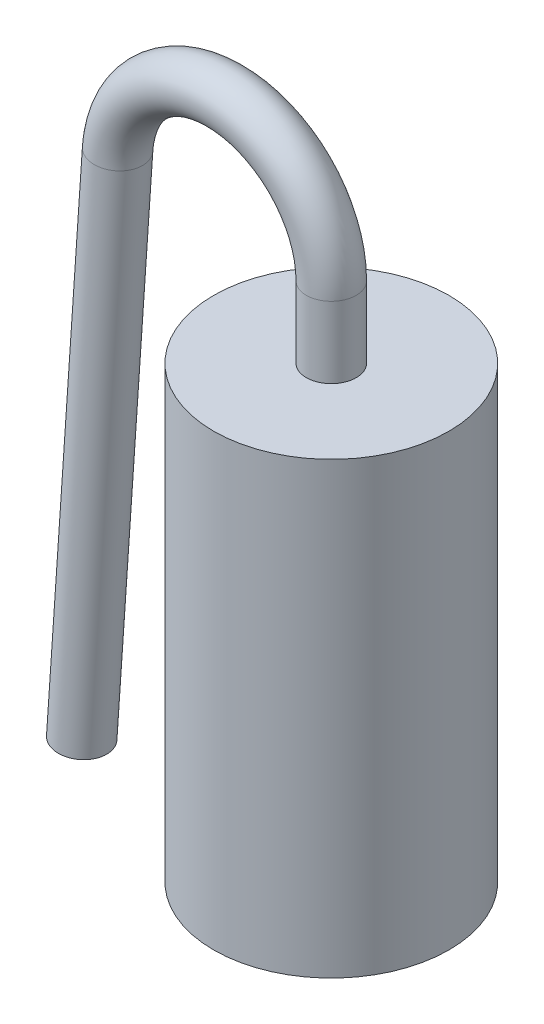
ISO-10303-21;
HEADER;
FILE_DESCRIPTION(('STEP AP214'),'2;1');
FILE_NAME('part.step','',(''),(''),'','','');
FILE_SCHEMA(('AUTOMOTIVE_DESIGN { 1 0 10303 214 1 1 1 1 }'));
ENDSEC;
DATA;
#1=APPLICATION_CONTEXT('core data for automotive mechanical design processes');
#2=APPLICATION_PROTOCOL_DEFINITION('international standard','automotive_design',2000,#1);
#3=PRODUCT_CONTEXT('',#1,'mechanical');
#4=PRODUCT('Part','Part','',(#3));
#5=PRODUCT_RELATED_PRODUCT_CATEGORY('part','',(#4));
#6=PRODUCT_DEFINITION_FORMATION('','',#4);
#7=PRODUCT_DEFINITION_CONTEXT('part definition',#1,'design');
#8=PRODUCT_DEFINITION('design','',#6,#7);
#9=PRODUCT_DEFINITION_SHAPE('','',#8);
#10=(LENGTH_UNIT() NAMED_UNIT(*) SI_UNIT(.MILLI.,.METRE.));
#11=(NAMED_UNIT(*) PLANE_ANGLE_UNIT() SI_UNIT($,.RADIAN.));
#12=(NAMED_UNIT(*) SI_UNIT($,.STERADIAN.) SOLID_ANGLE_UNIT());
#13=UNCERTAINTY_MEASURE_WITH_UNIT(LENGTH_MEASURE(1.E-05),#10,'distance_accuracy_value','');
#14=(GEOMETRIC_REPRESENTATION_CONTEXT(3) GLOBAL_UNCERTAINTY_ASSIGNED_CONTEXT((#13)) GLOBAL_UNIT_ASSIGNED_CONTEXT((#10,
#11,#12)) REPRESENTATION_CONTEXT('',''));
#15=CARTESIAN_POINT('',(0.,0.,0.));
#16=DIRECTION('',(0.,0.,1.));
#17=DIRECTION('',(1.,0.,0.));
#18=AXIS2_PLACEMENT_3D('',#15,#16,#17);
#19=CARTESIAN_POINT('',(-24.75353007138,3.947980609798,7.833372488685));
#20=DIRECTION('',(-0.0678615743200114,-0.99769474626802,0.));
#21=DIRECTION('',(0.99769474626802,-0.0678615743200114,0.));
#22=AXIS2_PLACEMENT_3D('',#19,#20,#21);
#23=PLANE('',#22);
#24=CARTESIAN_POINT('',(-24.753530071388,3.94798060979829,7.833372488685));
#25=DIRECTION('',(0.0678615743200114,0.99769474626802,0.));
#26=DIRECTION('',(-0.99769474626802,0.0678615743200114,0.));
#27=AXIS2_PLACEMENT_3D('',#24,#25,#26);
#28=CIRCLE('',#27,0.35);
#29=CARTESIAN_POINT('',(-25.1027232325818,3.97173216081029,7.833372488685));
#30=VERTEX_POINT('',#29);
#31=EDGE_CURVE('E18',#30,#30,#28,.T.);
#32=ORIENTED_EDGE('',*,*,#31,.F.);
#33=EDGE_LOOP('',(#32));
#34=FACE_BOUND('',#33,.T.);
#35=ADVANCED_FACE('F15',(#34),#23,.T.);
#36=CARTESIAN_POINT('',(-24.25007219079,11.349772971278,7.833372488685));
#37=DIRECTION('',(0.0678615743200114,0.99769474626802,0.));
#38=DIRECTION('',(-0.99769474626802,0.0678615743200114,0.));
#39=AXIS2_PLACEMENT_3D('',#36,#37,#38);
#40=CYLINDRICAL_SURFACE('',#39,0.35);
#41=ORIENTED_EDGE('',*,*,#31,.T.);
#42=EDGE_LOOP('',(#41));
#43=FACE_BOUND('',#42,.T.);
#44=CARTESIAN_POINT('',(-24.250072190782,11.3497729712778,7.833372488685));
#45=DIRECTION('',(-0.0678615743198951,-0.997694746268028,0.));
#46=DIRECTION('',(-0.997694746268028,0.067861574319895,0.));
#47=AXIS2_PLACEMENT_3D('',#44,#45,#46);
#48=CIRCLE('',#47,0.35);
#49=CARTESIAN_POINT('',(-24.5992653519758,11.3735245222898,7.833372488685));
#50=VERTEX_POINT('',#49);
#51=EDGE_CURVE('E30',#50,#50,#48,.F.);
#52=ORIENTED_EDGE('',*,*,#51,.F.);
#53=EDGE_LOOP('',(#52));
#54=FACE_BOUND('',#53,.T.);
#55=ADVANCED_FACE('F47',(#43,#54),#40,.T.);
#56=CARTESIAN_POINT('',(-22.75353007138,11.247980609798,7.833372488685));
#57=DIRECTION('',(0.,0.,1.));
#58=DIRECTION('',(1.,0.,0.));
#59=AXIS2_PLACEMENT_3D('',#56,#57,#58);
#60=TOROIDAL_SURFACE('',#59,1.5,0.35);
#61=ORIENTED_EDGE('',*,*,#51,.T.);
#62=EDGE_LOOP('',(#61));
#63=FACE_BOUND('',#62,.T.);
#64=CARTESIAN_POINT('',(-21.25353007138,11.247980609798,7.833372488685));
#65=DIRECTION('',(0.,1.,0.));
#66=DIRECTION('',(0.,0.,1.));
#67=AXIS2_PLACEMENT_3D('',#64,#65,#66);
#68=CIRCLE('',#67,0.35);
#69=CARTESIAN_POINT('',(-21.25353007138,11.247980609798,8.183372488685));
#70=VERTEX_POINT('',#69);
#71=EDGE_CURVE('E33',#70,#70,#68,.F.);
#72=ORIENTED_EDGE('',*,*,#71,.F.);
#73=EDGE_LOOP('',(#72));
#74=FACE_BOUND('',#73,.T.);
#75=ADVANCED_FACE('F43',(#63,#74),#60,.T.);
#76=CARTESIAN_POINT('',(-21.25353007138,11.247980609798,7.833372488685));
#77=DIRECTION('',(0.,1.,0.));
#78=DIRECTION('',(0.,0.,1.));
#79=AXIS2_PLACEMENT_3D('',#76,#77,#78);
#80=CYLINDRICAL_SURFACE('',#79,0.35);
#81=CARTESIAN_POINT('',(-21.25353007138,10.247980609798,7.833372488685));
#82=DIRECTION('',(0.,1.,0.));
#83=DIRECTION('',(0.,0.,1.));
#84=AXIS2_PLACEMENT_3D('',#81,#82,#83);
#85=CIRCLE('',#84,0.35);
#86=CARTESIAN_POINT('',(-21.25353007138,10.247980609798,8.183372488685));
#87=VERTEX_POINT('',#86);
#88=EDGE_CURVE('E27',#87,#87,#85,.F.);
#89=ORIENTED_EDGE('',*,*,#88,.F.);
#90=EDGE_LOOP('',(#89));
#91=FACE_BOUND('',#90,.T.);
#92=ORIENTED_EDGE('',*,*,#71,.T.);
#93=EDGE_LOOP('',(#92));
#94=FACE_BOUND('',#93,.T.);
#95=ADVANCED_FACE('F46',(#91,#94),#80,.T.);
#96=CARTESIAN_POINT('',(-21.25353007138,10.247980609798,7.833372488685));
#97=DIRECTION('',(0.,1.,0.));
#98=DIRECTION('',(0.,0.,1.));
#99=AXIS2_PLACEMENT_3D('',#96,#97,#98);
#100=PLANE('',#99);
#101=ORIENTED_EDGE('',*,*,#88,.T.);
#102=EDGE_LOOP('',(#101));
#103=FACE_BOUND('',#102,.T.);
#104=CARTESIAN_POINT('',(-21.25353007138,10.247980609798,7.833372488685));
#105=DIRECTION('',(0.,1.,0.));
#106=DIRECTION('',(0.,0.,1.));
#107=AXIS2_PLACEMENT_3D('',#104,#105,#106);
#108=CIRCLE('',#107,1.65);
#109=CARTESIAN_POINT('',(-21.25353007138,10.247980609798,9.483372488685));
#110=VERTEX_POINT('',#109);
#111=EDGE_CURVE('E22',#110,#110,#108,.F.);
#112=ORIENTED_EDGE('',*,*,#111,.F.);
#113=EDGE_LOOP('',(#112));
#114=FACE_BOUND('',#113,.T.);
#115=ADVANCED_FACE('F66',(#103,#114),#100,.T.);
#116=CARTESIAN_POINT('',(-21.25353007138,3.947980609798,7.833372488685));
#117=DIRECTION('',(0.,1.,0.));
#118=DIRECTION('',(0.,0.,1.));
#119=AXIS2_PLACEMENT_3D('',#116,#117,#118);
#120=PLANE('',#119);
#121=CARTESIAN_POINT('',(-21.25353007138,3.947980609798,7.833372488685));
#122=DIRECTION('',(0.,1.,0.));
#123=DIRECTION('',(0.,0.,1.));
#124=AXIS2_PLACEMENT_3D('',#121,#122,#123);
#125=CIRCLE('',#124,1.65);
#126=CARTESIAN_POINT('',(-21.25353007138,3.947980609798,9.483372488685));
#127=VERTEX_POINT('',#126);
#128=EDGE_CURVE('E10',#127,#127,#125,.T.);
#129=ORIENTED_EDGE('',*,*,#128,.F.);
#130=EDGE_LOOP('',(#129));
#131=FACE_BOUND('',#130,.T.);
#132=ADVANCED_FACE('F61',(#131),#120,.F.);
#133=CARTESIAN_POINT('',(-21.25353007138,10.247980609798,7.833372488685));
#134=DIRECTION('',(0.,1.,0.));
#135=DIRECTION('',(0.,0.,1.));
#136=AXIS2_PLACEMENT_3D('',#133,#134,#135);
#137=CYLINDRICAL_SURFACE('',#136,1.65);
#138=ORIENTED_EDGE('',*,*,#128,.T.);
#139=EDGE_LOOP('',(#138));
#140=FACE_BOUND('',#139,.T.);
#141=ORIENTED_EDGE('',*,*,#111,.T.);
#142=EDGE_LOOP('',(#141));
#143=FACE_BOUND('',#142,.T.);
#144=ADVANCED_FACE('F59',(#140,#143),#137,.T.);
#145=CLOSED_SHELL('',(#35,#55,#75,#95,#115,#132,#144));
#146=MANIFOLD_SOLID_BREP('B1',#145);
#147=ADVANCED_BREP_SHAPE_REPRESENTATION('',(#18,#146),#14);
#148=SHAPE_DEFINITION_REPRESENTATION(#9,#147);
ENDSEC;
END-ISO-10303-21;
